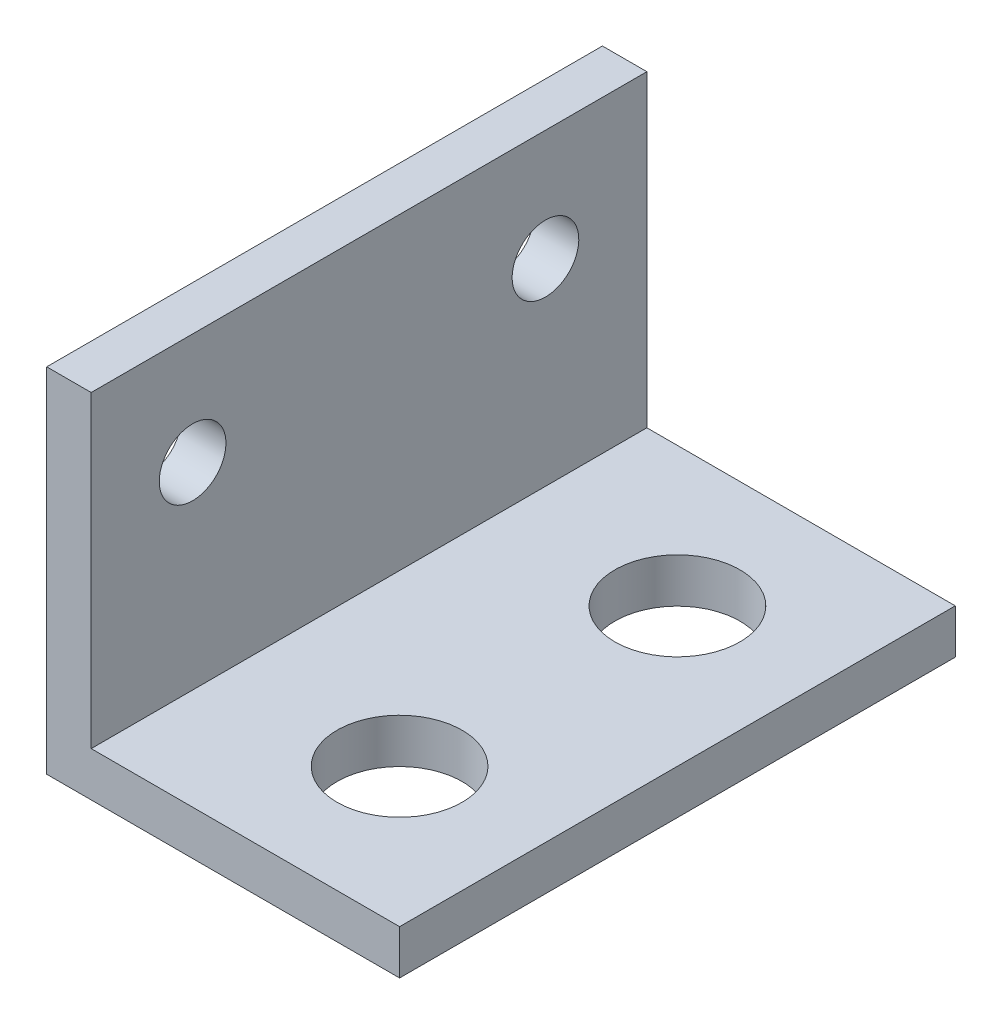
ISO-10303-21;
HEADER;
FILE_DESCRIPTION(('STEP AP214'),'2;1');
FILE_NAME('part.step','',(''),(''),'','','');
FILE_SCHEMA(('AUTOMOTIVE_DESIGN { 1 0 10303 214 1 1 1 1 }'));
ENDSEC;
DATA;
#1=APPLICATION_CONTEXT('core data for automotive mechanical design processes');
#2=APPLICATION_PROTOCOL_DEFINITION('international standard','automotive_design',2000,#1);
#3=PRODUCT_CONTEXT('',#1,'mechanical');
#4=PRODUCT('Part','Part','',(#3));
#5=PRODUCT_RELATED_PRODUCT_CATEGORY('part','',(#4));
#6=PRODUCT_DEFINITION_FORMATION('','',#4);
#7=PRODUCT_DEFINITION_CONTEXT('part definition',#1,'design');
#8=PRODUCT_DEFINITION('design','',#6,#7);
#9=PRODUCT_DEFINITION_SHAPE('','',#8);
#10=(LENGTH_UNIT() NAMED_UNIT(*) SI_UNIT(.MILLI.,.METRE.));
#11=(NAMED_UNIT(*) PLANE_ANGLE_UNIT() SI_UNIT($,.RADIAN.));
#12=(NAMED_UNIT(*) SI_UNIT($,.STERADIAN.) SOLID_ANGLE_UNIT());
#13=UNCERTAINTY_MEASURE_WITH_UNIT(LENGTH_MEASURE(1.E-05),#10,'distance_accuracy_value','');
#14=(GEOMETRIC_REPRESENTATION_CONTEXT(3) GLOBAL_UNCERTAINTY_ASSIGNED_CONTEXT((#13)) GLOBAL_UNIT_ASSIGNED_CONTEXT((#10,
#11,#12)) REPRESENTATION_CONTEXT('',''));
#15=CARTESIAN_POINT('',(0.,0.,0.));
#16=DIRECTION('',(0.,0.,1.));
#17=DIRECTION('',(1.,0.,0.));
#18=AXIS2_PLACEMENT_3D('',#15,#16,#17);
#19=CARTESIAN_POINT('',(12.7,0.,10.));
#20=DIRECTION('',(0.,-1.,0.));
#21=DIRECTION('',(1.,0.,0.));
#22=AXIS2_PLACEMENT_3D('',#19,#20,#21);
#23=PLANE('',#22);
#24=CARTESIAN_POINT('',(7.7,0.,5.));
#25=DIRECTION('',(0.,1.,0.));
#26=DIRECTION('',(0.,0.,1.));
#27=AXIS2_PLACEMENT_3D('',#24,#25,#26);
#28=CIRCLE('',#27,2.25);
#29=CARTESIAN_POINT('',(7.7,0.,7.25));
#30=VERTEX_POINT('',#29);
#31=EDGE_CURVE('E218',#30,#30,#28,.T.);
#32=ORIENTED_EDGE('',*,*,#31,.T.);
#33=EDGE_LOOP('',(#32));
#34=FACE_BOUND('',#33,.T.);
#35=CARTESIAN_POINT('',(7.7,0.,-5.));
#36=DIRECTION('',(0.,1.,0.));
#37=DIRECTION('',(0.,0.,1.));
#38=AXIS2_PLACEMENT_3D('',#35,#36,#37);
#39=CIRCLE('',#38,2.25);
#40=CARTESIAN_POINT('',(7.7,0.,-2.75));
#41=VERTEX_POINT('',#40);
#42=EDGE_CURVE('E141',#41,#41,#39,.T.);
#43=ORIENTED_EDGE('',*,*,#42,.T.);
#44=EDGE_LOOP('',(#43));
#45=FACE_BOUND('',#44,.T.);
#46=DIRECTION('',(-1.,0.,0.));
#47=VECTOR('',#46,1.);
#48=CARTESIAN_POINT('',(12.7,0.,-10.));
#49=LINE('',#48,#47);
#50=CARTESIAN_POINT('',(12.7,0.,-10.));
#51=VERTEX_POINT('',#50);
#52=CARTESIAN_POINT('',(0.,0.,-10.));
#53=VERTEX_POINT('',#52);
#54=EDGE_CURVE('E136',#51,#53,#49,.T.);
#55=ORIENTED_EDGE('',*,*,#54,.F.);
#56=DIRECTION('',(0.,0.,-1.));
#57=VECTOR('',#56,1.);
#58=CARTESIAN_POINT('',(12.7,0.,10.));
#59=LINE('',#58,#57);
#60=CARTESIAN_POINT('',(12.7,0.,10.));
#61=VERTEX_POINT('',#60);
#62=EDGE_CURVE('E11',#61,#51,#59,.T.);
#63=ORIENTED_EDGE('',*,*,#62,.F.);
#64=DIRECTION('',(-1.,0.,0.));
#65=VECTOR('',#64,1.);
#66=CARTESIAN_POINT('',(12.7,0.,10.));
#67=LINE('',#66,#65);
#68=CARTESIAN_POINT('',(0.,0.,10.));
#69=VERTEX_POINT('',#68);
#70=EDGE_CURVE('E157',#61,#69,#67,.T.);
#71=ORIENTED_EDGE('',*,*,#70,.T.);
#72=DIRECTION('',(0.,0.,-1.));
#73=VECTOR('',#72,1.);
#74=CARTESIAN_POINT('',(0.,0.,10.));
#75=LINE('',#74,#73);
#76=EDGE_CURVE('E48',#69,#53,#75,.T.);
#77=ORIENTED_EDGE('',*,*,#76,.T.);
#78=EDGE_LOOP('',(#55,#63,#71,#77));
#79=FACE_BOUND('',#78,.T.);
#80=ADVANCED_FACE('F45',(#34,#45,#79),#23,.T.);
#81=CARTESIAN_POINT('',(12.7,1.6002,10.));
#82=DIRECTION('',(1.,0.,0.));
#83=DIRECTION('',(0.,0.,-1.));
#84=AXIS2_PLACEMENT_3D('',#81,#82,#83);
#85=PLANE('',#84);
#86=DIRECTION('',(0.,-1.,0.));
#87=VECTOR('',#86,1.);
#88=CARTESIAN_POINT('',(12.7,1.6002,-10.));
#89=LINE('',#88,#87);
#90=CARTESIAN_POINT('',(12.7,1.6002,-10.));
#91=VERTEX_POINT('',#90);
#92=EDGE_CURVE('E154',#91,#51,#89,.T.);
#93=ORIENTED_EDGE('',*,*,#92,.F.);
#94=DIRECTION('',(0.,0.,-1.));
#95=VECTOR('',#94,1.);
#96=CARTESIAN_POINT('',(12.7,1.6002,10.));
#97=LINE('',#96,#95);
#98=CARTESIAN_POINT('',(12.7,1.6002,10.));
#99=VERTEX_POINT('',#98);
#100=EDGE_CURVE('E55',#99,#91,#97,.T.);
#101=ORIENTED_EDGE('',*,*,#100,.F.);
#102=DIRECTION('',(0.,-1.,0.));
#103=VECTOR('',#102,1.);
#104=CARTESIAN_POINT('',(12.7,1.6002,10.));
#105=LINE('',#104,#103);
#106=EDGE_CURVE('E122',#99,#61,#105,.T.);
#107=ORIENTED_EDGE('',*,*,#106,.T.);
#108=ORIENTED_EDGE('',*,*,#62,.T.);
#109=EDGE_LOOP('',(#93,#101,#107,#108));
#110=FACE_BOUND('',#109,.T.);
#111=ADVANCED_FACE('F169',(#110),#85,.T.);
#112=CARTESIAN_POINT('',(1.6002,1.6002,10.));
#113=DIRECTION('',(0.,1.,0.));
#114=DIRECTION('',(0.,0.,1.));
#115=AXIS2_PLACEMENT_3D('',#112,#113,#114);
#116=PLANE('',#115);
#117=CARTESIAN_POINT('',(7.7,1.6002,5.));
#118=DIRECTION('',(0.,1.,0.));
#119=DIRECTION('',(0.,0.,1.));
#120=AXIS2_PLACEMENT_3D('',#117,#118,#119);
#121=CIRCLE('',#120,2.24999999999999);
#122=CARTESIAN_POINT('',(7.7,1.6002,7.24999999999999));
#123=VERTEX_POINT('',#122);
#124=EDGE_CURVE('E209',#123,#123,#121,.T.);
#125=ORIENTED_EDGE('',*,*,#124,.F.);
#126=EDGE_LOOP('',(#125));
#127=FACE_BOUND('',#126,.T.);
#128=CARTESIAN_POINT('',(7.7,1.6002,-5.));
#129=DIRECTION('',(0.,1.,0.));
#130=DIRECTION('',(0.,0.,1.));
#131=AXIS2_PLACEMENT_3D('',#128,#129,#130);
#132=CIRCLE('',#131,2.24999999999999);
#133=CARTESIAN_POINT('',(7.7,1.6002,-2.75000000000001));
#134=VERTEX_POINT('',#133);
#135=EDGE_CURVE('E222',#134,#134,#132,.T.);
#136=ORIENTED_EDGE('',*,*,#135,.F.);
#137=EDGE_LOOP('',(#136));
#138=FACE_BOUND('',#137,.T.);
#139=DIRECTION('',(1.,0.,0.));
#140=VECTOR('',#139,1.);
#141=CARTESIAN_POINT('',(1.6002,1.6002,-10.));
#142=LINE('',#141,#140);
#143=CARTESIAN_POINT('',(1.6002,1.6002,-10.));
#144=VERTEX_POINT('',#143);
#145=EDGE_CURVE('E108',#144,#91,#142,.T.);
#146=ORIENTED_EDGE('',*,*,#145,.F.);
#147=DIRECTION('',(0.,0.,-1.));
#148=VECTOR('',#147,1.);
#149=CARTESIAN_POINT('',(1.6002,1.6002,10.));
#150=LINE('',#149,#148);
#151=CARTESIAN_POINT('',(1.6002,1.6002,10.));
#152=VERTEX_POINT('',#151);
#153=EDGE_CURVE('E103',#152,#144,#150,.T.);
#154=ORIENTED_EDGE('',*,*,#153,.F.);
#155=DIRECTION('',(1.,0.,0.));
#156=VECTOR('',#155,1.);
#157=CARTESIAN_POINT('',(1.6002,1.6002,10.));
#158=LINE('',#157,#156);
#159=EDGE_CURVE('E106',#152,#99,#158,.T.);
#160=ORIENTED_EDGE('',*,*,#159,.T.);
#161=ORIENTED_EDGE('',*,*,#100,.T.);
#162=EDGE_LOOP('',(#146,#154,#160,#161));
#163=FACE_BOUND('',#162,.T.);
#164=ADVANCED_FACE('F105',(#127,#138,#163),#116,.T.);
#165=CARTESIAN_POINT('',(1.6002,12.7,10.));
#166=DIRECTION('',(1.,0.,0.));
#167=DIRECTION('',(0.,1.,0.));
#168=AXIS2_PLACEMENT_3D('',#165,#166,#167);
#169=PLANE('',#168);
#170=CARTESIAN_POINT('',(1.6002,8.7,-6.35));
#171=DIRECTION('',(1.,0.,0.));
#172=DIRECTION('',(0.,1.,0.));
#173=AXIS2_PLACEMENT_3D('',#170,#171,#172);
#174=CIRCLE('',#173,1.2);
#175=CARTESIAN_POINT('',(1.6002,9.9,-6.35));
#176=VERTEX_POINT('',#175);
#177=EDGE_CURVE('E204',#176,#176,#174,.T.);
#178=ORIENTED_EDGE('',*,*,#177,.F.);
#179=EDGE_LOOP('',(#178));
#180=FACE_BOUND('',#179,.T.);
#181=CARTESIAN_POINT('',(1.6002,8.7,6.35));
#182=DIRECTION('',(1.,0.,0.));
#183=DIRECTION('',(0.,1.,0.));
#184=AXIS2_PLACEMENT_3D('',#181,#182,#183);
#185=CIRCLE('',#184,1.2);
#186=CARTESIAN_POINT('',(1.6002,9.9,6.35));
#187=VERTEX_POINT('',#186);
#188=EDGE_CURVE('E203',#187,#187,#185,.T.);
#189=ORIENTED_EDGE('',*,*,#188,.F.);
#190=EDGE_LOOP('',(#189));
#191=FACE_BOUND('',#190,.T.);
#192=DIRECTION('',(0.,-1.,0.));
#193=VECTOR('',#192,1.);
#194=CARTESIAN_POINT('',(1.6002,12.7,-10.));
#195=LINE('',#194,#193);
#196=CARTESIAN_POINT('',(1.6002,12.7,-10.));
#197=VERTEX_POINT('',#196);
#198=EDGE_CURVE('E149',#197,#144,#195,.T.);
#199=ORIENTED_EDGE('',*,*,#198,.F.);
#200=DIRECTION('',(0.,0.,-1.));
#201=VECTOR('',#200,1.);
#202=CARTESIAN_POINT('',(1.6002,12.7,10.));
#203=LINE('',#202,#201);
#204=CARTESIAN_POINT('',(1.6002,12.7,10.));
#205=VERTEX_POINT('',#204);
#206=EDGE_CURVE('E114',#205,#197,#203,.T.);
#207=ORIENTED_EDGE('',*,*,#206,.F.);
#208=DIRECTION('',(0.,-1.,0.));
#209=VECTOR('',#208,1.);
#210=CARTESIAN_POINT('',(1.6002,12.7,10.));
#211=LINE('',#210,#209);
#212=EDGE_CURVE('E120',#205,#152,#211,.T.);
#213=ORIENTED_EDGE('',*,*,#212,.T.);
#214=ORIENTED_EDGE('',*,*,#153,.T.);
#215=EDGE_LOOP('',(#199,#207,#213,#214));
#216=FACE_BOUND('',#215,.T.);
#217=ADVANCED_FACE('F125',(#180,#191,#216),#169,.T.);
#218=CARTESIAN_POINT('',(0.,12.7,10.));
#219=DIRECTION('',(0.,1.,0.));
#220=DIRECTION('',(0.,0.,1.));
#221=AXIS2_PLACEMENT_3D('',#218,#219,#220);
#222=PLANE('',#221);
#223=DIRECTION('',(1.,0.,0.));
#224=VECTOR('',#223,1.);
#225=CARTESIAN_POINT('',(0.,12.7,-10.));
#226=LINE('',#225,#224);
#227=CARTESIAN_POINT('',(0.,12.7,-10.));
#228=VERTEX_POINT('',#227);
#229=EDGE_CURVE('E145',#228,#197,#226,.T.);
#230=ORIENTED_EDGE('',*,*,#229,.F.);
#231=DIRECTION('',(0.,0.,-1.));
#232=VECTOR('',#231,1.);
#233=CARTESIAN_POINT('',(0.,12.7,10.));
#234=LINE('',#233,#232);
#235=CARTESIAN_POINT('',(0.,12.7,10.));
#236=VERTEX_POINT('',#235);
#237=EDGE_CURVE('E162',#236,#228,#234,.T.);
#238=ORIENTED_EDGE('',*,*,#237,.F.);
#239=DIRECTION('',(1.,0.,0.));
#240=VECTOR('',#239,1.);
#241=CARTESIAN_POINT('',(0.,12.7,10.));
#242=LINE('',#241,#240);
#243=EDGE_CURVE('E127',#236,#205,#242,.T.);
#244=ORIENTED_EDGE('',*,*,#243,.T.);
#245=ORIENTED_EDGE('',*,*,#206,.T.);
#246=EDGE_LOOP('',(#230,#238,#244,#245));
#247=FACE_BOUND('',#246,.T.);
#248=ADVANCED_FACE('F185',(#247),#222,.T.);
#249=CARTESIAN_POINT('',(0.,0.,10.));
#250=DIRECTION('',(-1.,0.,0.));
#251=DIRECTION('',(0.,0.,1.));
#252=AXIS2_PLACEMENT_3D('',#249,#250,#251);
#253=PLANE('',#252);
#254=CARTESIAN_POINT('',(0.,8.7,-6.35));
#255=DIRECTION('',(-1.,0.,0.));
#256=DIRECTION('',(0.,0.,1.));
#257=AXIS2_PLACEMENT_3D('',#254,#255,#256);
#258=CIRCLE('',#257,1.2);
#259=CARTESIAN_POINT('',(0.,8.7,-5.15));
#260=VERTEX_POINT('',#259);
#261=EDGE_CURVE('E197',#260,#260,#258,.T.);
#262=ORIENTED_EDGE('',*,*,#261,.F.);
#263=EDGE_LOOP('',(#262));
#264=FACE_BOUND('',#263,.T.);
#265=CARTESIAN_POINT('',(0.,8.7,6.35));
#266=DIRECTION('',(-1.,0.,0.));
#267=DIRECTION('',(0.,0.,1.));
#268=AXIS2_PLACEMENT_3D('',#265,#266,#267);
#269=CIRCLE('',#268,1.2);
#270=CARTESIAN_POINT('',(0.,8.7,7.55));
#271=VERTEX_POINT('',#270);
#272=EDGE_CURVE('E200',#271,#271,#269,.T.);
#273=ORIENTED_EDGE('',*,*,#272,.F.);
#274=EDGE_LOOP('',(#273));
#275=FACE_BOUND('',#274,.T.);
#276=DIRECTION('',(0.,1.,0.));
#277=VECTOR('',#276,1.);
#278=CARTESIAN_POINT('',(0.,0.,-10.));
#279=LINE('',#278,#277);
#280=EDGE_CURVE('E140',#53,#228,#279,.T.);
#281=ORIENTED_EDGE('',*,*,#280,.F.);
#282=ORIENTED_EDGE('',*,*,#76,.F.);
#283=DIRECTION('',(0.,1.,0.));
#284=VECTOR('',#283,1.);
#285=CARTESIAN_POINT('',(0.,0.,10.));
#286=LINE('',#285,#284);
#287=EDGE_CURVE('E130',#69,#236,#286,.T.);
#288=ORIENTED_EDGE('',*,*,#287,.T.);
#289=ORIENTED_EDGE('',*,*,#237,.T.);
#290=EDGE_LOOP('',(#281,#282,#288,#289));
#291=FACE_BOUND('',#290,.T.);
#292=ADVANCED_FACE('F166',(#264,#275,#291),#253,.T.);
#293=CARTESIAN_POINT('',(0.,0.,10.));
#294=DIRECTION('',(0.,0.,-1.));
#295=DIRECTION('',(-1.,0.,0.));
#296=AXIS2_PLACEMENT_3D('',#293,#294,#295);
#297=PLANE('',#296);
#298=ORIENTED_EDGE('',*,*,#70,.F.);
#299=ORIENTED_EDGE('',*,*,#106,.F.);
#300=ORIENTED_EDGE('',*,*,#159,.F.);
#301=ORIENTED_EDGE('',*,*,#212,.F.);
#302=ORIENTED_EDGE('',*,*,#243,.F.);
#303=ORIENTED_EDGE('',*,*,#287,.F.);
#304=EDGE_LOOP('',(#298,#299,#300,#301,#302,#303));
#305=FACE_BOUND('',#304,.T.);
#306=ADVANCED_FACE('F118',(#305),#297,.F.);
#307=CARTESIAN_POINT('',(0.,0.,-10.));
#308=DIRECTION('',(0.,0.,-1.));
#309=DIRECTION('',(-1.,0.,0.));
#310=AXIS2_PLACEMENT_3D('',#307,#308,#309);
#311=PLANE('',#310);
#312=ORIENTED_EDGE('',*,*,#54,.T.);
#313=ORIENTED_EDGE('',*,*,#280,.T.);
#314=ORIENTED_EDGE('',*,*,#229,.T.);
#315=ORIENTED_EDGE('',*,*,#198,.T.);
#316=ORIENTED_EDGE('',*,*,#145,.T.);
#317=ORIENTED_EDGE('',*,*,#92,.T.);
#318=EDGE_LOOP('',(#312,#313,#314,#315,#316,#317));
#319=FACE_BOUND('',#318,.T.);
#320=ADVANCED_FACE('F168',(#319),#311,.T.);
#321=CARTESIAN_POINT('',(7.7,1.6002,-5.));
#322=DIRECTION('',(0.,1.,0.));
#323=DIRECTION('',(0.,0.,1.));
#324=AXIS2_PLACEMENT_3D('',#321,#322,#323);
#325=CYLINDRICAL_SURFACE('',#324,2.24999999999999);
#326=ORIENTED_EDGE('',*,*,#42,.F.);
#327=EDGE_LOOP('',(#326));
#328=FACE_BOUND('',#327,.T.);
#329=ORIENTED_EDGE('',*,*,#135,.T.);
#330=EDGE_LOOP('',(#329));
#331=FACE_BOUND('',#330,.T.);
#332=ADVANCED_FACE('F234',(#328,#331),#325,.F.);
#333=CARTESIAN_POINT('',(7.7,1.6002,5.));
#334=DIRECTION('',(0.,1.,0.));
#335=DIRECTION('',(0.,0.,1.));
#336=AXIS2_PLACEMENT_3D('',#333,#334,#335);
#337=CYLINDRICAL_SURFACE('',#336,2.24999999999999);
#338=ORIENTED_EDGE('',*,*,#31,.F.);
#339=EDGE_LOOP('',(#338));
#340=FACE_BOUND('',#339,.T.);
#341=ORIENTED_EDGE('',*,*,#124,.T.);
#342=EDGE_LOOP('',(#341));
#343=FACE_BOUND('',#342,.T.);
#344=ADVANCED_FACE('F237',(#340,#343),#337,.F.);
#345=CARTESIAN_POINT('',(0.,8.7,6.35));
#346=DIRECTION('',(-1.,0.,0.));
#347=DIRECTION('',(0.,0.,1.));
#348=AXIS2_PLACEMENT_3D('',#345,#346,#347);
#349=CYLINDRICAL_SURFACE('',#348,1.2);
#350=ORIENTED_EDGE('',*,*,#188,.T.);
#351=EDGE_LOOP('',(#350));
#352=FACE_BOUND('',#351,.T.);
#353=ORIENTED_EDGE('',*,*,#272,.T.);
#354=EDGE_LOOP('',(#353));
#355=FACE_BOUND('',#354,.T.);
#356=ADVANCED_FACE('F244',(#352,#355),#349,.F.);
#357=CARTESIAN_POINT('',(0.,8.7,-6.35));
#358=DIRECTION('',(-1.,0.,0.));
#359=DIRECTION('',(0.,0.,1.));
#360=AXIS2_PLACEMENT_3D('',#357,#358,#359);
#361=CYLINDRICAL_SURFACE('',#360,1.2);
#362=ORIENTED_EDGE('',*,*,#177,.T.);
#363=EDGE_LOOP('',(#362));
#364=FACE_BOUND('',#363,.T.);
#365=ORIENTED_EDGE('',*,*,#261,.T.);
#366=EDGE_LOOP('',(#365));
#367=FACE_BOUND('',#366,.T.);
#368=ADVANCED_FACE('F250',(#364,#367),#361,.F.);
#369=CLOSED_SHELL('',(#80,#111,#164,#217,#248,#292,#306,#320,#332,#344,#356,#368));
#370=MANIFOLD_SOLID_BREP('B2',#369);
#371=ADVANCED_BREP_SHAPE_REPRESENTATION('',(#18,#370),#14);
#372=SHAPE_DEFINITION_REPRESENTATION(#9,#371);
ENDSEC;
END-ISO-10303-21;
